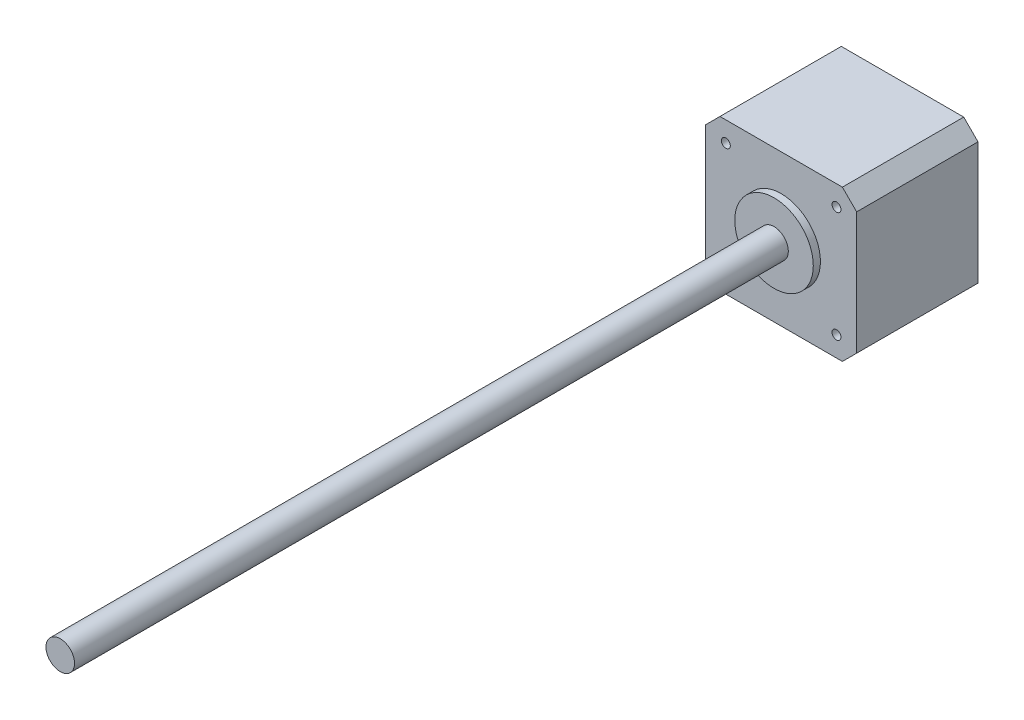
ISO-10303-21;
HEADER;
FILE_DESCRIPTION(('STEP AP214'),'2;1');
FILE_NAME('part.step','',(''),(''),'','','');
FILE_SCHEMA(('AUTOMOTIVE_DESIGN { 1 0 10303 214 1 1 1 1 }'));
ENDSEC;
DATA;
#1=APPLICATION_CONTEXT('core data for automotive mechanical design processes');
#2=APPLICATION_PROTOCOL_DEFINITION('international standard','automotive_design',2000,#1);
#3=PRODUCT_CONTEXT('',#1,'mechanical');
#4=PRODUCT('Part','Part','',(#3));
#5=PRODUCT_RELATED_PRODUCT_CATEGORY('part','',(#4));
#6=PRODUCT_DEFINITION_FORMATION('','',#4);
#7=PRODUCT_DEFINITION_CONTEXT('part definition',#1,'design');
#8=PRODUCT_DEFINITION('design','',#6,#7);
#9=PRODUCT_DEFINITION_SHAPE('','',#8);
#10=(LENGTH_UNIT() NAMED_UNIT(*) SI_UNIT(.MILLI.,.METRE.));
#11=(NAMED_UNIT(*) PLANE_ANGLE_UNIT() SI_UNIT($,.RADIAN.));
#12=(NAMED_UNIT(*) SI_UNIT($,.STERADIAN.) SOLID_ANGLE_UNIT());
#13=UNCERTAINTY_MEASURE_WITH_UNIT(LENGTH_MEASURE(1.E-05),#10,'distance_accuracy_value','');
#14=(GEOMETRIC_REPRESENTATION_CONTEXT(3) GLOBAL_UNCERTAINTY_ASSIGNED_CONTEXT((#13)) GLOBAL_UNIT_ASSIGNED_CONTEXT((#10,
#11,#12)) REPRESENTATION_CONTEXT('',''));
#15=CARTESIAN_POINT('',(0.,0.,0.));
#16=DIRECTION('',(0.,0.,1.));
#17=DIRECTION('',(1.,0.,0.));
#18=AXIS2_PLACEMENT_3D('',#15,#16,#17);
#19=CARTESIAN_POINT('',(21.15,21.15,34.));
#20=DIRECTION('',(-1.,0.,0.));
#21=DIRECTION('',(0.,0.,1.));
#22=AXIS2_PLACEMENT_3D('',#19,#20,#21);
#23=PLANE('',#22);
#24=DIRECTION('',(0.,1.,0.));
#25=VECTOR('',#24,1.);
#26=CARTESIAN_POINT('',(21.15,21.15,34.));
#27=LINE('',#26,#25);
#28=CARTESIAN_POINT('',(21.15,-17.15,34.));
#29=VERTEX_POINT('',#28);
#30=CARTESIAN_POINT('',(21.15,17.1499999999999,34.));
#31=VERTEX_POINT('',#30);
#32=EDGE_CURVE('E141',#29,#31,#27,.T.);
#33=ORIENTED_EDGE('',*,*,#32,.F.);
#34=DIRECTION('',(0.,0.,-1.));
#35=VECTOR('',#34,1.);
#36=CARTESIAN_POINT('',(21.15,-17.15,34.));
#37=LINE('',#36,#35);
#38=CARTESIAN_POINT('',(21.15,-17.15,0.));
#39=VERTEX_POINT('',#38);
#40=EDGE_CURVE('E167',#29,#39,#37,.T.);
#41=ORIENTED_EDGE('',*,*,#40,.T.);
#42=DIRECTION('',(0.,1.,0.));
#43=VECTOR('',#42,1.);
#44=CARTESIAN_POINT('',(21.15,21.15,0.));
#45=LINE('',#44,#43);
#46=CARTESIAN_POINT('',(21.15,17.1499999999999,0.));
#47=VERTEX_POINT('',#46);
#48=EDGE_CURVE('E175',#39,#47,#45,.T.);
#49=ORIENTED_EDGE('',*,*,#48,.T.);
#50=DIRECTION('',(0.,0.,1.));
#51=VECTOR('',#50,1.);
#52=CARTESIAN_POINT('',(21.15,17.1499999999999,34.));
#53=LINE('',#52,#51);
#54=EDGE_CURVE('E165',#47,#31,#53,.T.);
#55=ORIENTED_EDGE('',*,*,#54,.T.);
#56=EDGE_LOOP('',(#33,#41,#49,#55));
#57=FACE_BOUND('',#56,.T.);
#58=ADVANCED_FACE('F50',(#57),#23,.F.);
#59=CARTESIAN_POINT('',(-21.15,21.15,34.));
#60=DIRECTION('',(0.,-1.,0.));
#61=DIRECTION('',(0.,0.,-1.));
#62=AXIS2_PLACEMENT_3D('',#59,#60,#61);
#63=PLANE('',#62);
#64=DIRECTION('',(-1.,0.,0.));
#65=VECTOR('',#64,1.);
#66=CARTESIAN_POINT('',(-21.15,21.15,0.));
#67=LINE('',#66,#65);
#68=CARTESIAN_POINT('',(17.15,21.15,0.));
#69=VERTEX_POINT('',#68);
#70=CARTESIAN_POINT('',(-17.1499999999999,21.15,0.));
#71=VERTEX_POINT('',#70);
#72=EDGE_CURVE('E146',#69,#71,#67,.T.);
#73=ORIENTED_EDGE('',*,*,#72,.T.);
#74=DIRECTION('',(0.,0.,1.));
#75=VECTOR('',#74,1.);
#76=CARTESIAN_POINT('',(-17.1499999999999,21.15,34.));
#77=LINE('',#76,#75);
#78=CARTESIAN_POINT('',(-17.1499999999999,21.15,34.));
#79=VERTEX_POINT('',#78);
#80=EDGE_CURVE('E13',#71,#79,#77,.T.);
#81=ORIENTED_EDGE('',*,*,#80,.T.);
#82=DIRECTION('',(-1.,0.,0.));
#83=VECTOR('',#82,1.);
#84=CARTESIAN_POINT('',(-21.15,21.15,34.));
#85=LINE('',#84,#83);
#86=CARTESIAN_POINT('',(17.15,21.15,34.));
#87=VERTEX_POINT('',#86);
#88=EDGE_CURVE('E144',#87,#79,#85,.T.);
#89=ORIENTED_EDGE('',*,*,#88,.F.);
#90=DIRECTION('',(0.,0.,-1.));
#91=VECTOR('',#90,1.);
#92=CARTESIAN_POINT('',(17.15,21.15,34.));
#93=LINE('',#92,#91);
#94=EDGE_CURVE('E58',#87,#69,#93,.T.);
#95=ORIENTED_EDGE('',*,*,#94,.T.);
#96=EDGE_LOOP('',(#73,#81,#89,#95));
#97=FACE_BOUND('',#96,.T.);
#98=ADVANCED_FACE('F172',(#97),#63,.F.);
#99=CARTESIAN_POINT('',(-21.15,21.15,34.));
#100=DIRECTION('',(1.,0.,0.));
#101=DIRECTION('',(0.,1.,0.));
#102=AXIS2_PLACEMENT_3D('',#99,#100,#101);
#103=PLANE('',#102);
#104=DIRECTION('',(0.,-1.,0.));
#105=VECTOR('',#104,1.);
#106=CARTESIAN_POINT('',(-21.15,21.15,0.));
#107=LINE('',#106,#105);
#108=CARTESIAN_POINT('',(-21.15,17.15,0.));
#109=VERTEX_POINT('',#108);
#110=CARTESIAN_POINT('',(-21.15,-17.15,0.));
#111=VERTEX_POINT('',#110);
#112=EDGE_CURVE('E142',#109,#111,#107,.T.);
#113=ORIENTED_EDGE('',*,*,#112,.T.);
#114=DIRECTION('',(0.,0.,1.));
#115=VECTOR('',#114,1.);
#116=CARTESIAN_POINT('',(-21.15,-17.15,34.));
#117=LINE('',#116,#115);
#118=CARTESIAN_POINT('',(-21.15,-17.15,34.));
#119=VERTEX_POINT('',#118);
#120=EDGE_CURVE('E120',#111,#119,#117,.T.);
#121=ORIENTED_EDGE('',*,*,#120,.T.);
#122=DIRECTION('',(0.,-1.,0.));
#123=VECTOR('',#122,1.);
#124=CARTESIAN_POINT('',(-21.15,21.15,34.));
#125=LINE('',#124,#123);
#126=CARTESIAN_POINT('',(-21.15,17.15,34.));
#127=VERTEX_POINT('',#126);
#128=EDGE_CURVE('E180',#127,#119,#125,.T.);
#129=ORIENTED_EDGE('',*,*,#128,.F.);
#130=DIRECTION('',(0.,0.,-1.));
#131=VECTOR('',#130,1.);
#132=CARTESIAN_POINT('',(-21.15,17.15,34.));
#133=LINE('',#132,#131);
#134=EDGE_CURVE('E125',#127,#109,#133,.T.);
#135=ORIENTED_EDGE('',*,*,#134,.T.);
#136=EDGE_LOOP('',(#113,#121,#129,#135));
#137=FACE_BOUND('',#136,.T.);
#138=ADVANCED_FACE('F244',(#137),#103,.F.);
#139=CARTESIAN_POINT('',(-21.15,-21.15,34.));
#140=DIRECTION('',(0.,1.,0.));
#141=DIRECTION('',(0.,0.,1.));
#142=AXIS2_PLACEMENT_3D('',#139,#140,#141);
#143=PLANE('',#142);
#144=DIRECTION('',(1.,0.,0.));
#145=VECTOR('',#144,1.);
#146=CARTESIAN_POINT('',(-21.15,-21.15,34.));
#147=LINE('',#146,#145);
#148=CARTESIAN_POINT('',(-17.15,-21.15,34.));
#149=VERTEX_POINT('',#148);
#150=CARTESIAN_POINT('',(17.1499999999999,-21.15,34.));
#151=VERTEX_POINT('',#150);
#152=EDGE_CURVE('E135',#149,#151,#147,.T.);
#153=ORIENTED_EDGE('',*,*,#152,.F.);
#154=DIRECTION('',(0.,0.,-1.));
#155=VECTOR('',#154,1.);
#156=CARTESIAN_POINT('',(-17.15,-21.15,34.));
#157=LINE('',#156,#155);
#158=CARTESIAN_POINT('',(-17.15,-21.15,0.));
#159=VERTEX_POINT('',#158);
#160=EDGE_CURVE('E119',#149,#159,#157,.T.);
#161=ORIENTED_EDGE('',*,*,#160,.T.);
#162=DIRECTION('',(1.,0.,0.));
#163=VECTOR('',#162,1.);
#164=CARTESIAN_POINT('',(-21.15,-21.15,0.));
#165=LINE('',#164,#163);
#166=CARTESIAN_POINT('',(17.1499999999999,-21.15,0.));
#167=VERTEX_POINT('',#166);
#168=EDGE_CURVE('E132',#159,#167,#165,.T.);
#169=ORIENTED_EDGE('',*,*,#168,.T.);
#170=DIRECTION('',(0.,0.,1.));
#171=VECTOR('',#170,1.);
#172=CARTESIAN_POINT('',(17.1499999999999,-21.15,34.));
#173=LINE('',#172,#171);
#174=EDGE_CURVE('E137',#167,#151,#173,.T.);
#175=ORIENTED_EDGE('',*,*,#174,.T.);
#176=EDGE_LOOP('',(#153,#161,#169,#175));
#177=FACE_BOUND('',#176,.T.);
#178=ADVANCED_FACE('F131',(#177),#143,.F.);
#179=CARTESIAN_POINT('',(0.,0.,34.));
#180=DIRECTION('',(0.,0.,1.));
#181=DIRECTION('',(1.,0.,0.));
#182=AXIS2_PLACEMENT_3D('',#179,#180,#181);
#183=PLANE('',#182);
#184=CARTESIAN_POINT('',(-15.5,-15.5,34.));
#185=DIRECTION('',(0.,0.,1.));
#186=DIRECTION('',(1.,0.,0.));
#187=AXIS2_PLACEMENT_3D('',#184,#185,#186);
#188=CIRCLE('',#187,1.25);
#189=CARTESIAN_POINT('',(-14.25,-15.5,34.));
#190=VERTEX_POINT('',#189);
#191=EDGE_CURVE('E214',#190,#190,#188,.T.);
#192=ORIENTED_EDGE('',*,*,#191,.F.);
#193=EDGE_LOOP('',(#192));
#194=FACE_BOUND('',#193,.T.);
#195=CARTESIAN_POINT('',(15.5,-15.5,34.));
#196=DIRECTION('',(0.,0.,1.));
#197=DIRECTION('',(1.,0.,0.));
#198=AXIS2_PLACEMENT_3D('',#195,#196,#197);
#199=CIRCLE('',#198,1.25);
#200=CARTESIAN_POINT('',(16.75,-15.5,34.));
#201=VERTEX_POINT('',#200);
#202=EDGE_CURVE('E208',#201,#201,#199,.T.);
#203=ORIENTED_EDGE('',*,*,#202,.F.);
#204=EDGE_LOOP('',(#203));
#205=FACE_BOUND('',#204,.T.);
#206=CARTESIAN_POINT('',(15.5,15.5,34.));
#207=DIRECTION('',(0.,0.,1.));
#208=DIRECTION('',(1.,0.,0.));
#209=AXIS2_PLACEMENT_3D('',#206,#207,#208);
#210=CIRCLE('',#209,1.25);
#211=CARTESIAN_POINT('',(16.75,15.5,34.));
#212=VERTEX_POINT('',#211);
#213=EDGE_CURVE('E202',#212,#212,#210,.T.);
#214=ORIENTED_EDGE('',*,*,#213,.F.);
#215=EDGE_LOOP('',(#214));
#216=FACE_BOUND('',#215,.T.);
#217=CARTESIAN_POINT('',(-15.5,15.5,34.));
#218=DIRECTION('',(0.,0.,1.));
#219=DIRECTION('',(1.,0.,0.));
#220=AXIS2_PLACEMENT_3D('',#217,#218,#219);
#221=CIRCLE('',#220,1.25);
#222=CARTESIAN_POINT('',(-14.25,15.5,34.));
#223=VERTEX_POINT('',#222);
#224=EDGE_CURVE('E196',#223,#223,#221,.T.);
#225=ORIENTED_EDGE('',*,*,#224,.F.);
#226=EDGE_LOOP('',(#225));
#227=FACE_BOUND('',#226,.T.);
#228=CARTESIAN_POINT('',(0.,0.,34.));
#229=DIRECTION('',(0.,0.,1.));
#230=DIRECTION('',(1.,0.,0.));
#231=AXIS2_PLACEMENT_3D('',#228,#229,#230);
#232=CIRCLE('',#231,11.);
#233=CARTESIAN_POINT('',(11.,0.,34.));
#234=VERTEX_POINT('',#233);
#235=EDGE_CURVE('E184',#234,#234,#232,.T.);
#236=ORIENTED_EDGE('',*,*,#235,.F.);
#237=EDGE_LOOP('',(#236));
#238=FACE_BOUND('',#237,.T.);
#239=ORIENTED_EDGE('',*,*,#128,.T.);
#240=DIRECTION('',(-0.707106781186548,0.707106781186548,0.));
#241=VECTOR('',#240,1.);
#242=CARTESIAN_POINT('',(-19.15,-19.15,34.));
#243=LINE('',#242,#241);
#244=EDGE_CURVE('E163',#119,#149,#243,.F.);
#245=ORIENTED_EDGE('',*,*,#244,.T.);
#246=ORIENTED_EDGE('',*,*,#152,.T.);
#247=DIRECTION('',(-0.70710678118655,-0.707106781186545,0.));
#248=VECTOR('',#247,1.);
#249=CARTESIAN_POINT('',(19.1499999999999,-19.15,34.));
#250=LINE('',#249,#248);
#251=EDGE_CURVE('E161',#151,#29,#250,.F.);
#252=ORIENTED_EDGE('',*,*,#251,.T.);
#253=ORIENTED_EDGE('',*,*,#32,.T.);
#254=DIRECTION('',(0.707106781186545,-0.70710678118655,0.));
#255=VECTOR('',#254,1.);
#256=CARTESIAN_POINT('',(19.15,19.1499999999999,34.));
#257=LINE('',#256,#255);
#258=EDGE_CURVE('E70',#31,#87,#257,.F.);
#259=ORIENTED_EDGE('',*,*,#258,.T.);
#260=ORIENTED_EDGE('',*,*,#88,.T.);
#261=DIRECTION('',(0.70710678118655,0.707106781186545,0.));
#262=VECTOR('',#261,1.);
#263=CARTESIAN_POINT('',(-19.1499999999999,19.15,34.));
#264=LINE('',#263,#262);
#265=EDGE_CURVE('E159',#79,#127,#264,.F.);
#266=ORIENTED_EDGE('',*,*,#265,.T.);
#267=EDGE_LOOP('',(#239,#245,#246,#252,#253,#259,#260,#266));
#268=FACE_BOUND('',#267,.T.);
#269=ADVANCED_FACE('F229',(#194,#205,#216,#227,#238,#268),#183,.T.);
#270=CARTESIAN_POINT('',(0.,0.,0.));
#271=DIRECTION('',(0.,0.,1.));
#272=DIRECTION('',(1.,0.,0.));
#273=AXIS2_PLACEMENT_3D('',#270,#271,#272);
#274=PLANE('',#273);
#275=ORIENTED_EDGE('',*,*,#168,.F.);
#276=DIRECTION('',(0.707106781186548,-0.707106781186548,0.));
#277=VECTOR('',#276,1.);
#278=CARTESIAN_POINT('',(-17.15,-21.15,0.));
#279=LINE('',#278,#277);
#280=EDGE_CURVE('E115',#159,#111,#279,.F.);
#281=ORIENTED_EDGE('',*,*,#280,.T.);
#282=ORIENTED_EDGE('',*,*,#112,.F.);
#283=DIRECTION('',(-0.70710678118655,-0.707106781186545,0.));
#284=VECTOR('',#283,1.);
#285=CARTESIAN_POINT('',(-21.15,17.15,0.));
#286=LINE('',#285,#284);
#287=EDGE_CURVE('E152',#109,#71,#286,.F.);
#288=ORIENTED_EDGE('',*,*,#287,.T.);
#289=ORIENTED_EDGE('',*,*,#72,.F.);
#290=DIRECTION('',(-0.707106781186545,0.70710678118655,0.));
#291=VECTOR('',#290,1.);
#292=CARTESIAN_POINT('',(17.15,21.15,0.));
#293=LINE('',#292,#291);
#294=EDGE_CURVE('E136',#69,#47,#293,.F.);
#295=ORIENTED_EDGE('',*,*,#294,.T.);
#296=ORIENTED_EDGE('',*,*,#48,.F.);
#297=DIRECTION('',(0.70710678118655,0.707106781186545,0.));
#298=VECTOR('',#297,1.);
#299=CARTESIAN_POINT('',(21.15,-17.15,0.));
#300=LINE('',#299,#298);
#301=EDGE_CURVE('E126',#39,#167,#300,.F.);
#302=ORIENTED_EDGE('',*,*,#301,.T.);
#303=EDGE_LOOP('',(#275,#281,#282,#288,#289,#295,#296,#302));
#304=FACE_BOUND('',#303,.T.);
#305=ADVANCED_FACE('F139',(#304),#274,.F.);
#306=CARTESIAN_POINT('',(0.,0.,36.));
#307=DIRECTION('',(0.,0.,-1.));
#308=DIRECTION('',(-1.,0.,0.));
#309=AXIS2_PLACEMENT_3D('',#306,#307,#308);
#310=CYLINDRICAL_SURFACE('',#309,11.);
#311=CARTESIAN_POINT('',(0.,0.,36.));
#312=DIRECTION('',(0.,0.,1.));
#313=DIRECTION('',(1.,0.,0.));
#314=AXIS2_PLACEMENT_3D('',#311,#312,#313);
#315=CIRCLE('',#314,11.);
#316=CARTESIAN_POINT('',(11.,0.,36.));
#317=VERTEX_POINT('',#316);
#318=EDGE_CURVE('E176',#317,#317,#315,.T.);
#319=ORIENTED_EDGE('',*,*,#318,.F.);
#320=EDGE_LOOP('',(#319));
#321=FACE_BOUND('',#320,.T.);
#322=ORIENTED_EDGE('',*,*,#235,.T.);
#323=EDGE_LOOP('',(#322));
#324=FACE_BOUND('',#323,.T.);
#325=ADVANCED_FACE('F285',(#321,#324),#310,.T.);
#326=CARTESIAN_POINT('',(0.,0.,36.));
#327=DIRECTION('',(0.,0.,1.));
#328=DIRECTION('',(1.,0.,0.));
#329=AXIS2_PLACEMENT_3D('',#326,#327,#328);
#330=PLANE('',#329);
#331=CARTESIAN_POINT('',(0.,0.,36.));
#332=DIRECTION('',(0.,0.,1.));
#333=DIRECTION('',(1.,0.,0.));
#334=AXIS2_PLACEMENT_3D('',#331,#332,#333);
#335=CIRCLE('',#334,4.);
#336=CARTESIAN_POINT('',(4.,0.,36.));
#337=VERTEX_POINT('',#336);
#338=EDGE_CURVE('E190',#337,#337,#335,.T.);
#339=ORIENTED_EDGE('',*,*,#338,.F.);
#340=EDGE_LOOP('',(#339));
#341=FACE_BOUND('',#340,.T.);
#342=ORIENTED_EDGE('',*,*,#318,.T.);
#343=EDGE_LOOP('',(#342));
#344=FACE_BOUND('',#343,.T.);
#345=ADVANCED_FACE('F277',(#341,#344),#330,.T.);
#346=CARTESIAN_POINT('',(0.,0.,236.));
#347=DIRECTION('',(0.,0.,-1.));
#348=DIRECTION('',(-1.,0.,0.));
#349=AXIS2_PLACEMENT_3D('',#346,#347,#348);
#350=CYLINDRICAL_SURFACE('',#349,4.);
#351=CARTESIAN_POINT('',(0.,0.,236.));
#352=DIRECTION('',(0.,0.,1.));
#353=DIRECTION('',(1.,0.,0.));
#354=AXIS2_PLACEMENT_3D('',#351,#352,#353);
#355=CIRCLE('',#354,4.);
#356=CARTESIAN_POINT('',(4.,0.,236.));
#357=VERTEX_POINT('',#356);
#358=EDGE_CURVE('E187',#357,#357,#355,.T.);
#359=ORIENTED_EDGE('',*,*,#358,.F.);
#360=EDGE_LOOP('',(#359));
#361=FACE_BOUND('',#360,.T.);
#362=ORIENTED_EDGE('',*,*,#338,.T.);
#363=EDGE_LOOP('',(#362));
#364=FACE_BOUND('',#363,.T.);
#365=ADVANCED_FACE('F271',(#361,#364),#350,.T.);
#366=CARTESIAN_POINT('',(0.,0.,236.));
#367=DIRECTION('',(0.,0.,1.));
#368=DIRECTION('',(1.,0.,0.));
#369=AXIS2_PLACEMENT_3D('',#366,#367,#368);
#370=PLANE('',#369);
#371=ORIENTED_EDGE('',*,*,#358,.T.);
#372=EDGE_LOOP('',(#371));
#373=FACE_BOUND('',#372,.T.);
#374=ADVANCED_FACE('F267',(#373),#370,.T.);
#375=CARTESIAN_POINT('',(-17.15,-21.15,34.));
#376=DIRECTION('',(0.707106781186547,0.707106781186547,0.));
#377=DIRECTION('',(0.,0.,-1.));
#378=AXIS2_PLACEMENT_3D('',#375,#376,#377);
#379=PLANE('',#378);
#380=ORIENTED_EDGE('',*,*,#244,.F.);
#381=ORIENTED_EDGE('',*,*,#120,.F.);
#382=ORIENTED_EDGE('',*,*,#280,.F.);
#383=ORIENTED_EDGE('',*,*,#160,.F.);
#384=EDGE_LOOP('',(#380,#381,#382,#383));
#385=FACE_BOUND('',#384,.T.);
#386=ADVANCED_FACE('F118',(#385),#379,.F.);
#387=CARTESIAN_POINT('',(21.15,-17.15,34.));
#388=DIRECTION('',(-0.707106781186545,0.70710678118655,0.));
#389=DIRECTION('',(0.,0.,-1.));
#390=AXIS2_PLACEMENT_3D('',#387,#388,#389);
#391=PLANE('',#390);
#392=ORIENTED_EDGE('',*,*,#251,.F.);
#393=ORIENTED_EDGE('',*,*,#174,.F.);
#394=ORIENTED_EDGE('',*,*,#301,.F.);
#395=ORIENTED_EDGE('',*,*,#40,.F.);
#396=EDGE_LOOP('',(#392,#393,#394,#395));
#397=FACE_BOUND('',#396,.T.);
#398=ADVANCED_FACE('F248',(#397),#391,.F.);
#399=CARTESIAN_POINT('',(-21.15,17.15,34.));
#400=DIRECTION('',(0.707106781186545,-0.70710678118655,0.));
#401=DIRECTION('',(0.,0.,-1.));
#402=AXIS2_PLACEMENT_3D('',#399,#400,#401);
#403=PLANE('',#402);
#404=ORIENTED_EDGE('',*,*,#265,.F.);
#405=ORIENTED_EDGE('',*,*,#80,.F.);
#406=ORIENTED_EDGE('',*,*,#287,.F.);
#407=ORIENTED_EDGE('',*,*,#134,.F.);
#408=EDGE_LOOP('',(#404,#405,#406,#407));
#409=FACE_BOUND('',#408,.T.);
#410=ADVANCED_FACE('F246',(#409),#403,.F.);
#411=CARTESIAN_POINT('',(17.15,21.15,34.));
#412=DIRECTION('',(-0.70710678118655,-0.707106781186545,0.));
#413=DIRECTION('',(0.,0.,-1.));
#414=AXIS2_PLACEMENT_3D('',#411,#412,#413);
#415=PLANE('',#414);
#416=ORIENTED_EDGE('',*,*,#258,.F.);
#417=ORIENTED_EDGE('',*,*,#54,.F.);
#418=ORIENTED_EDGE('',*,*,#294,.F.);
#419=ORIENTED_EDGE('',*,*,#94,.F.);
#420=EDGE_LOOP('',(#416,#417,#418,#419));
#421=FACE_BOUND('',#420,.T.);
#422=ADVANCED_FACE('F52',(#421),#415,.F.);
#423=CARTESIAN_POINT('',(-15.5,15.5,24.));
#424=DIRECTION('',(0.,0.,1.));
#425=DIRECTION('',(1.,0.,0.));
#426=AXIS2_PLACEMENT_3D('',#423,#424,#425);
#427=CYLINDRICAL_SURFACE('',#426,1.25);
#428=CARTESIAN_POINT('',(-15.5,15.5,24.));
#429=DIRECTION('',(0.,0.,1.));
#430=DIRECTION('',(1.,0.,0.));
#431=AXIS2_PLACEMENT_3D('',#428,#429,#430);
#432=CIRCLE('',#431,1.25);
#433=CARTESIAN_POINT('',(-14.25,15.5,24.));
#434=VERTEX_POINT('',#433);
#435=EDGE_CURVE('E193',#434,#434,#432,.T.);
#436=ORIENTED_EDGE('',*,*,#435,.F.);
#437=EDGE_LOOP('',(#436));
#438=FACE_BOUND('',#437,.T.);
#439=ORIENTED_EDGE('',*,*,#224,.T.);
#440=EDGE_LOOP('',(#439));
#441=FACE_BOUND('',#440,.T.);
#442=ADVANCED_FACE('F253',(#438,#441),#427,.F.);
#443=CARTESIAN_POINT('',(-15.5,15.5,24.));
#444=DIRECTION('',(0.,0.,1.));
#445=DIRECTION('',(1.,0.,0.));
#446=AXIS2_PLACEMENT_3D('',#443,#444,#445);
#447=PLANE('',#446);
#448=ORIENTED_EDGE('',*,*,#435,.T.);
#449=EDGE_LOOP('',(#448));
#450=FACE_BOUND('',#449,.T.);
#451=ADVANCED_FACE('F363',(#450),#447,.T.);
#452=CARTESIAN_POINT('',(15.5,15.5,24.));
#453=DIRECTION('',(0.,0.,1.));
#454=DIRECTION('',(1.,0.,0.));
#455=AXIS2_PLACEMENT_3D('',#452,#453,#454);
#456=CYLINDRICAL_SURFACE('',#455,1.25);
#457=CARTESIAN_POINT('',(15.5,15.5,24.));
#458=DIRECTION('',(0.,0.,1.));
#459=DIRECTION('',(1.,0.,0.));
#460=AXIS2_PLACEMENT_3D('',#457,#458,#459);
#461=CIRCLE('',#460,1.25);
#462=CARTESIAN_POINT('',(16.75,15.5,24.));
#463=VERTEX_POINT('',#462);
#464=EDGE_CURVE('E199',#463,#463,#461,.T.);
#465=ORIENTED_EDGE('',*,*,#464,.F.);
#466=EDGE_LOOP('',(#465));
#467=FACE_BOUND('',#466,.T.);
#468=ORIENTED_EDGE('',*,*,#213,.T.);
#469=EDGE_LOOP('',(#468));
#470=FACE_BOUND('',#469,.T.);
#471=ADVANCED_FACE('F372',(#467,#470),#456,.F.);
#472=CARTESIAN_POINT('',(15.5,15.5,24.));
#473=DIRECTION('',(0.,0.,1.));
#474=DIRECTION('',(1.,0.,0.));
#475=AXIS2_PLACEMENT_3D('',#472,#473,#474);
#476=PLANE('',#475);
#477=ORIENTED_EDGE('',*,*,#464,.T.);
#478=EDGE_LOOP('',(#477));
#479=FACE_BOUND('',#478,.T.);
#480=ADVANCED_FACE('F381',(#479),#476,.T.);
#481=CARTESIAN_POINT('',(15.5,-15.5,24.));
#482=DIRECTION('',(0.,0.,1.));
#483=DIRECTION('',(1.,0.,0.));
#484=AXIS2_PLACEMENT_3D('',#481,#482,#483);
#485=CYLINDRICAL_SURFACE('',#484,1.25);
#486=CARTESIAN_POINT('',(15.5,-15.5,24.));
#487=DIRECTION('',(0.,0.,1.));
#488=DIRECTION('',(1.,0.,0.));
#489=AXIS2_PLACEMENT_3D('',#486,#487,#488);
#490=CIRCLE('',#489,1.25);
#491=CARTESIAN_POINT('',(16.75,-15.5,24.));
#492=VERTEX_POINT('',#491);
#493=EDGE_CURVE('E205',#492,#492,#490,.T.);
#494=ORIENTED_EDGE('',*,*,#493,.F.);
#495=EDGE_LOOP('',(#494));
#496=FACE_BOUND('',#495,.T.);
#497=ORIENTED_EDGE('',*,*,#202,.T.);
#498=EDGE_LOOP('',(#497));
#499=FACE_BOUND('',#498,.T.);
#500=ADVANCED_FACE('F391',(#496,#499),#485,.F.);
#501=CARTESIAN_POINT('',(15.5,-15.5,24.));
#502=DIRECTION('',(0.,0.,1.));
#503=DIRECTION('',(1.,0.,0.));
#504=AXIS2_PLACEMENT_3D('',#501,#502,#503);
#505=PLANE('',#504);
#506=ORIENTED_EDGE('',*,*,#493,.T.);
#507=EDGE_LOOP('',(#506));
#508=FACE_BOUND('',#507,.T.);
#509=ADVANCED_FACE('F225',(#508),#505,.T.);
#510=CARTESIAN_POINT('',(-15.5,-15.5,24.));
#511=DIRECTION('',(0.,0.,1.));
#512=DIRECTION('',(1.,0.,0.));
#513=AXIS2_PLACEMENT_3D('',#510,#511,#512);
#514=CYLINDRICAL_SURFACE('',#513,1.25);
#515=CARTESIAN_POINT('',(-15.5,-15.5,24.));
#516=DIRECTION('',(0.,0.,1.));
#517=DIRECTION('',(1.,0.,0.));
#518=AXIS2_PLACEMENT_3D('',#515,#516,#517);
#519=CIRCLE('',#518,1.25);
#520=CARTESIAN_POINT('',(-14.25,-15.5,24.));
#521=VERTEX_POINT('',#520);
#522=EDGE_CURVE('E211',#521,#521,#519,.T.);
#523=ORIENTED_EDGE('',*,*,#522,.F.);
#524=EDGE_LOOP('',(#523));
#525=FACE_BOUND('',#524,.T.);
#526=ORIENTED_EDGE('',*,*,#191,.T.);
#527=EDGE_LOOP('',(#526));
#528=FACE_BOUND('',#527,.T.);
#529=ADVANCED_FACE('F222',(#525,#528),#514,.F.);
#530=CARTESIAN_POINT('',(-15.5,-15.5,24.));
#531=DIRECTION('',(0.,0.,1.));
#532=DIRECTION('',(1.,0.,0.));
#533=AXIS2_PLACEMENT_3D('',#530,#531,#532);
#534=PLANE('',#533);
#535=ORIENTED_EDGE('',*,*,#522,.T.);
#536=EDGE_LOOP('',(#535));
#537=FACE_BOUND('',#536,.T.);
#538=ADVANCED_FACE('F220',(#537),#534,.T.);
#539=CLOSED_SHELL('',(#58,#98,#138,#178,#269,#305,#325,#345,#365,#374,#386,#398,#410,#422,#442,
#451,#471,#480,#500,#509,#529,#538));
#540=MANIFOLD_SOLID_BREP('B2',#539);
#541=ADVANCED_BREP_SHAPE_REPRESENTATION('',(#18,#540),#14);
#542=SHAPE_DEFINITION_REPRESENTATION(#9,#541);
ENDSEC;
END-ISO-10303-21;
